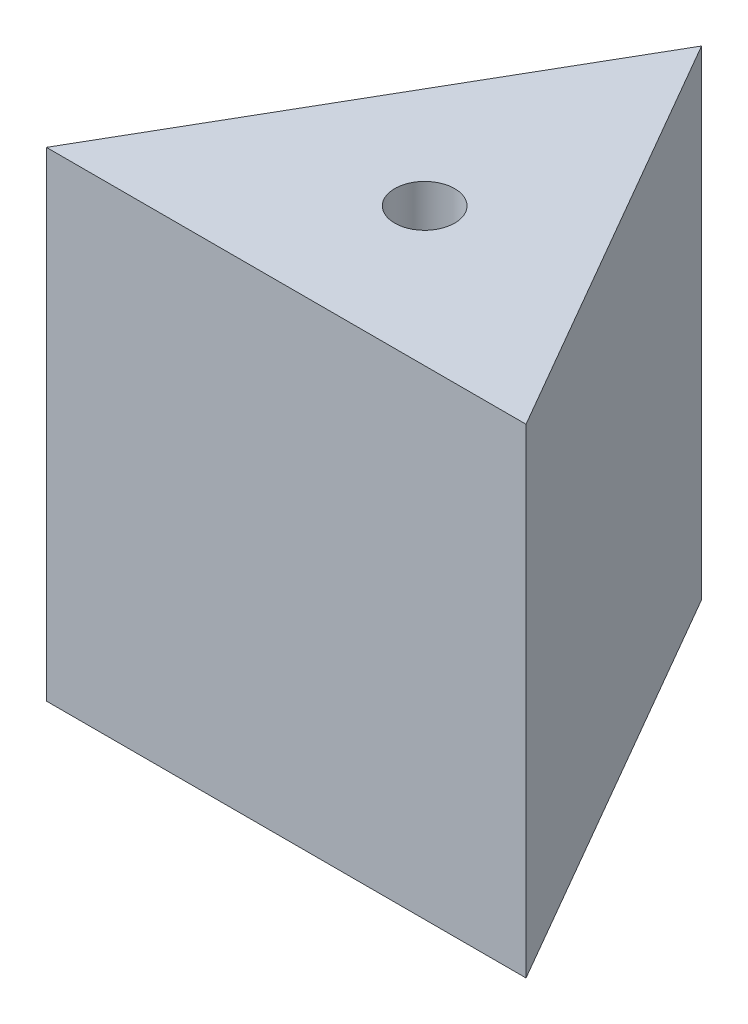
ISO-10303-21;
HEADER;
FILE_DESCRIPTION(('STEP AP214'),'2;1');
FILE_NAME('part.step','',(''),(''),'','','');
FILE_SCHEMA(('AUTOMOTIVE_DESIGN { 1 0 10303 214 1 1 1 1 }'));
ENDSEC;
DATA;
#1=APPLICATION_CONTEXT('core data for automotive mechanical design processes');
#2=APPLICATION_PROTOCOL_DEFINITION('international standard','automotive_design',2000,#1);
#3=PRODUCT_CONTEXT('',#1,'mechanical');
#4=PRODUCT('Part','Part','',(#3));
#5=PRODUCT_RELATED_PRODUCT_CATEGORY('part','',(#4));
#6=PRODUCT_DEFINITION_FORMATION('','',#4);
#7=PRODUCT_DEFINITION_CONTEXT('part definition',#1,'design');
#8=PRODUCT_DEFINITION('design','',#6,#7);
#9=PRODUCT_DEFINITION_SHAPE('','',#8);
#10=(LENGTH_UNIT() NAMED_UNIT(*) SI_UNIT(.MILLI.,.METRE.));
#11=(NAMED_UNIT(*) PLANE_ANGLE_UNIT() SI_UNIT($,.RADIAN.));
#12=(NAMED_UNIT(*) SI_UNIT($,.STERADIAN.) SOLID_ANGLE_UNIT());
#13=UNCERTAINTY_MEASURE_WITH_UNIT(LENGTH_MEASURE(1.E-05),#10,'distance_accuracy_value','');
#14=(GEOMETRIC_REPRESENTATION_CONTEXT(3) GLOBAL_UNCERTAINTY_ASSIGNED_CONTEXT((#13)) GLOBAL_UNIT_ASSIGNED_CONTEXT((#10,
#11,#12)) REPRESENTATION_CONTEXT('',''));
#15=CARTESIAN_POINT('',(0.,0.,0.));
#16=DIRECTION('',(0.,0.,1.));
#17=DIRECTION('',(1.,0.,0.));
#18=AXIS2_PLACEMENT_3D('',#15,#16,#17);
#19=CARTESIAN_POINT('',(152.4,304.8,263.964543073497));
#20=DIRECTION('',(-0.866025403784439,0.,0.5));
#21=DIRECTION('',(0.5,0.,0.866025403784439));
#22=AXIS2_PLACEMENT_3D('',#19,#20,#21);
#23=PLANE('',#22);
#24=DIRECTION('',(-0.5,0.,-0.866025403784439));
#25=VECTOR('',#24,1.);
#26=CARTESIAN_POINT('',(152.4,0.,263.964543073497));
#27=LINE('',#26,#25);
#28=CARTESIAN_POINT('',(152.4,0.,263.964543073497));
#29=VERTEX_POINT('',#28);
#30=CARTESIAN_POINT('',(0.,0.,0.));
#31=VERTEX_POINT('',#30);
#32=EDGE_CURVE('E79',#29,#31,#27,.T.);
#33=ORIENTED_EDGE('',*,*,#32,.T.);
#34=DIRECTION('',(0.,-1.,0.));
#35=VECTOR('',#34,1.);
#36=CARTESIAN_POINT('',(0.,304.8,0.));
#37=LINE('',#36,#35);
#38=CARTESIAN_POINT('',(0.,304.8,0.));
#39=VERTEX_POINT('',#38);
#40=EDGE_CURVE('E11',#39,#31,#37,.T.);
#41=ORIENTED_EDGE('',*,*,#40,.F.);
#42=DIRECTION('',(-0.5,0.,-0.866025403784439));
#43=VECTOR('',#42,1.);
#44=CARTESIAN_POINT('',(152.4,304.8,263.964543073497));
#45=LINE('',#44,#43);
#46=CARTESIAN_POINT('',(152.4,304.8,263.964543073497));
#47=VERTEX_POINT('',#46);
#48=EDGE_CURVE('E72',#47,#39,#45,.T.);
#49=ORIENTED_EDGE('',*,*,#48,.F.);
#50=DIRECTION('',(0.,-1.,0.));
#51=VECTOR('',#50,1.);
#52=CARTESIAN_POINT('',(152.4,304.8,263.964543073497));
#53=LINE('',#52,#51);
#54=EDGE_CURVE('E80',#47,#29,#53,.T.);
#55=ORIENTED_EDGE('',*,*,#54,.T.);
#56=EDGE_LOOP('',(#33,#41,#49,#55));
#57=FACE_BOUND('',#56,.T.);
#58=ADVANCED_FACE('F32',(#57),#23,.F.);
#59=CARTESIAN_POINT('',(0.,304.8,0.));
#60=DIRECTION('',(0.866025403784439,0.,0.5));
#61=DIRECTION('',(0.5,0.,-0.866025403784439));
#62=AXIS2_PLACEMENT_3D('',#59,#60,#61);
#63=PLANE('',#62);
#64=DIRECTION('',(-0.5,0.,0.866025403784439));
#65=VECTOR('',#64,1.);
#66=CARTESIAN_POINT('',(0.,0.,0.));
#67=LINE('',#66,#65);
#68=CARTESIAN_POINT('',(-152.4,0.,263.964543073497));
#69=VERTEX_POINT('',#68);
#70=EDGE_CURVE('E60',#31,#69,#67,.T.);
#71=ORIENTED_EDGE('',*,*,#70,.T.);
#72=DIRECTION('',(0.,-1.,0.));
#73=VECTOR('',#72,1.);
#74=CARTESIAN_POINT('',(-152.4,304.8,263.964543073497));
#75=LINE('',#74,#73);
#76=CARTESIAN_POINT('',(-152.4,304.8,263.964543073497));
#77=VERTEX_POINT('',#76);
#78=EDGE_CURVE('E40',#77,#69,#75,.T.);
#79=ORIENTED_EDGE('',*,*,#78,.F.);
#80=DIRECTION('',(-0.5,0.,0.866025403784439));
#81=VECTOR('',#80,1.);
#82=CARTESIAN_POINT('',(0.,304.8,0.));
#83=LINE('',#82,#81);
#84=EDGE_CURVE('E68',#39,#77,#83,.T.);
#85=ORIENTED_EDGE('',*,*,#84,.F.);
#86=ORIENTED_EDGE('',*,*,#40,.T.);
#87=EDGE_LOOP('',(#71,#79,#85,#86));
#88=FACE_BOUND('',#87,.T.);
#89=ADVANCED_FACE('F69',(#88),#63,.F.);
#90=CARTESIAN_POINT('',(-152.4,304.8,263.964543073497));
#91=DIRECTION('',(0.,0.,-1.));
#92=DIRECTION('',(-1.,0.,0.));
#93=AXIS2_PLACEMENT_3D('',#90,#91,#92);
#94=PLANE('',#93);
#95=DIRECTION('',(1.,0.,0.));
#96=VECTOR('',#95,1.);
#97=CARTESIAN_POINT('',(-152.4,0.,263.964543073497));
#98=LINE('',#97,#96);
#99=EDGE_CURVE('E65',#69,#29,#98,.T.);
#100=ORIENTED_EDGE('',*,*,#99,.T.);
#101=ORIENTED_EDGE('',*,*,#54,.F.);
#102=DIRECTION('',(1.,0.,0.));
#103=VECTOR('',#102,1.);
#104=CARTESIAN_POINT('',(-152.4,304.8,263.964543073497));
#105=LINE('',#104,#103);
#106=EDGE_CURVE('E48',#77,#47,#105,.T.);
#107=ORIENTED_EDGE('',*,*,#106,.F.);
#108=ORIENTED_EDGE('',*,*,#78,.T.);
#109=EDGE_LOOP('',(#100,#101,#107,#108));
#110=FACE_BOUND('',#109,.T.);
#111=ADVANCED_FACE('F91',(#110),#94,.F.);
#112=CARTESIAN_POINT('',(0.,304.8,0.));
#113=DIRECTION('',(0.,1.,0.));
#114=DIRECTION('',(0.,0.,1.));
#115=AXIS2_PLACEMENT_3D('',#112,#113,#114);
#116=PLANE('',#115);
#117=CARTESIAN_POINT('',(0.,304.8,175.976362048998));
#118=DIRECTION('',(0.,1.,0.));
#119=DIRECTION('',(0.,0.,1.));
#120=AXIS2_PLACEMENT_3D('',#117,#118,#119);
#121=CIRCLE('',#120,19.05);
#122=CARTESIAN_POINT('',(0.,304.8,195.026362048998));
#123=VERTEX_POINT('',#122);
#124=EDGE_CURVE('E86',#123,#123,#121,.T.);
#125=ORIENTED_EDGE('',*,*,#124,.F.);
#126=EDGE_LOOP('',(#125));
#127=FACE_BOUND('',#126,.T.);
#128=ORIENTED_EDGE('',*,*,#48,.T.);
#129=ORIENTED_EDGE('',*,*,#84,.T.);
#130=ORIENTED_EDGE('',*,*,#106,.T.);
#131=EDGE_LOOP('',(#128,#129,#130));
#132=FACE_BOUND('',#131,.T.);
#133=ADVANCED_FACE('F75',(#127,#132),#116,.T.);
#134=CARTESIAN_POINT('',(0.,0.,0.));
#135=DIRECTION('',(0.,1.,0.));
#136=DIRECTION('',(0.,0.,1.));
#137=AXIS2_PLACEMENT_3D('',#134,#135,#136);
#138=PLANE('',#137);
#139=CARTESIAN_POINT('',(0.,0.,175.976362048998));
#140=DIRECTION('',(0.,1.,0.));
#141=DIRECTION('',(0.,0.,1.));
#142=AXIS2_PLACEMENT_3D('',#139,#140,#141);
#143=CIRCLE('',#142,19.05);
#144=CARTESIAN_POINT('',(0.,0.,195.026362048998));
#145=VERTEX_POINT('',#144);
#146=EDGE_CURVE('E82',#145,#145,#143,.T.);
#147=ORIENTED_EDGE('',*,*,#146,.T.);
#148=EDGE_LOOP('',(#147));
#149=FACE_BOUND('',#148,.T.);
#150=ORIENTED_EDGE('',*,*,#32,.F.);
#151=ORIENTED_EDGE('',*,*,#99,.F.);
#152=ORIENTED_EDGE('',*,*,#70,.F.);
#153=EDGE_LOOP('',(#150,#151,#152));
#154=FACE_BOUND('',#153,.T.);
#155=ADVANCED_FACE('F92',(#149,#154),#138,.F.);
#156=CARTESIAN_POINT('',(0.,0.,175.976362048998));
#157=DIRECTION('',(0.,1.,0.));
#158=DIRECTION('',(0.,0.,1.));
#159=AXIS2_PLACEMENT_3D('',#156,#157,#158);
#160=CYLINDRICAL_SURFACE('',#159,19.05);
#161=ORIENTED_EDGE('',*,*,#146,.F.);
#162=EDGE_LOOP('',(#161));
#163=FACE_BOUND('',#162,.T.);
#164=ORIENTED_EDGE('',*,*,#124,.T.);
#165=EDGE_LOOP('',(#164));
#166=FACE_BOUND('',#165,.T.);
#167=ADVANCED_FACE('F94',(#163,#166),#160,.F.);
#168=CLOSED_SHELL('',(#58,#89,#111,#133,#155,#167));
#169=MANIFOLD_SOLID_BREP('B2',#168);
#170=ADVANCED_BREP_SHAPE_REPRESENTATION('',(#18,#169),#14);
#171=SHAPE_DEFINITION_REPRESENTATION(#9,#170);
ENDSEC;
END-ISO-10303-21;
